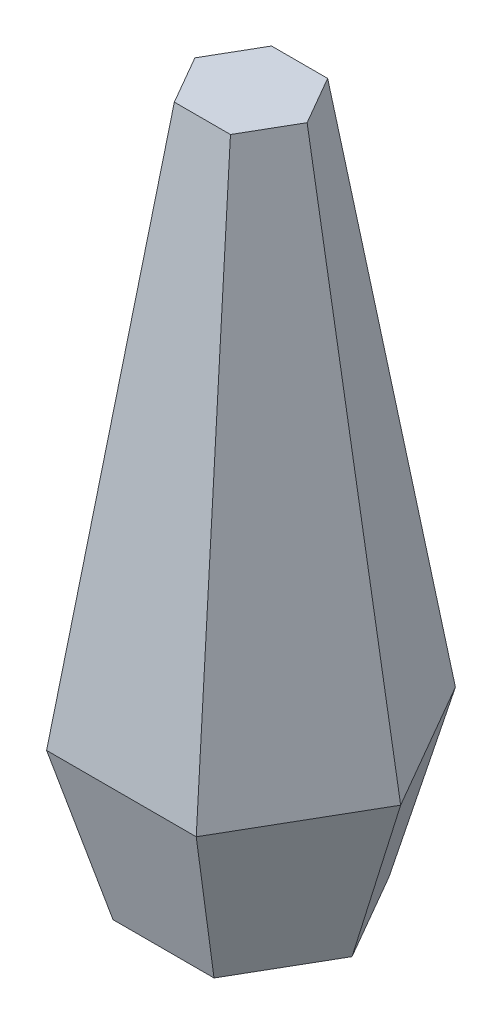
ISO-10303-21;
HEADER;
FILE_DESCRIPTION(('STEP AP214'),'2;1');
FILE_NAME('part.step','',(''),(''),'','','');
FILE_SCHEMA(('AUTOMOTIVE_DESIGN { 1 0 10303 214 1 1 1 1 }'));
ENDSEC;
DATA;
#1=APPLICATION_CONTEXT('core data for automotive mechanical design processes');
#2=APPLICATION_PROTOCOL_DEFINITION('international standard','automotive_design',2000,#1);
#3=PRODUCT_CONTEXT('',#1,'mechanical');
#4=PRODUCT('Part','Part','',(#3));
#5=PRODUCT_RELATED_PRODUCT_CATEGORY('part','',(#4));
#6=PRODUCT_DEFINITION_FORMATION('','',#4);
#7=PRODUCT_DEFINITION_CONTEXT('part definition',#1,'design');
#8=PRODUCT_DEFINITION('design','',#6,#7);
#9=PRODUCT_DEFINITION_SHAPE('','',#8);
#10=(LENGTH_UNIT() NAMED_UNIT(*) SI_UNIT(.MILLI.,.METRE.));
#11=(NAMED_UNIT(*) PLANE_ANGLE_UNIT() SI_UNIT($,.RADIAN.));
#12=(NAMED_UNIT(*) SI_UNIT($,.STERADIAN.) SOLID_ANGLE_UNIT());
#13=UNCERTAINTY_MEASURE_WITH_UNIT(LENGTH_MEASURE(1.E-05),#10,'distance_accuracy_value','');
#14=(GEOMETRIC_REPRESENTATION_CONTEXT(3) GLOBAL_UNCERTAINTY_ASSIGNED_CONTEXT((#13)) GLOBAL_UNIT_ASSIGNED_CONTEXT((#10,
#11,#12)) REPRESENTATION_CONTEXT('',''));
#15=CARTESIAN_POINT('',(0.,0.,0.));
#16=DIRECTION('',(0.,0.,1.));
#17=DIRECTION('',(1.,0.,0.));
#18=AXIS2_PLACEMENT_3D('',#15,#16,#17);
#19=CARTESIAN_POINT('',(395.946814610246,0.,0.));
#20=DIRECTION('',(0.,1.,0.));
#21=DIRECTION('',(0.,0.,1.));
#22=AXIS2_PLACEMENT_3D('',#19,#20,#21);
#23=PLANE('',#22);
#24=DIRECTION('',(0.5,0.,-0.866025403784439));
#25=VECTOR('',#24,1.);
#26=CARTESIAN_POINT('',(197.973407305123,0.,342.900000000001));
#27=LINE('',#26,#25);
#28=CARTESIAN_POINT('',(197.973407305123,0.,342.900000000001));
#29=VERTEX_POINT('',#28);
#30=CARTESIAN_POINT('',(395.946814610246,0.,0.));
#31=VERTEX_POINT('',#30);
#32=EDGE_CURVE('E205',#29,#31,#27,.T.);
#33=ORIENTED_EDGE('',*,*,#32,.F.);
#34=DIRECTION('',(1.,0.,0.));
#35=VECTOR('',#34,1.);
#36=CARTESIAN_POINT('',(-197.973407305123,0.,342.900000000001));
#37=LINE('',#36,#35);
#38=CARTESIAN_POINT('',(-197.973407305123,0.,342.900000000001));
#39=VERTEX_POINT('',#38);
#40=EDGE_CURVE('E12',#39,#29,#37,.T.);
#41=ORIENTED_EDGE('',*,*,#40,.F.);
#42=DIRECTION('',(0.5,0.,0.866025403784439));
#43=VECTOR('',#42,1.);
#44=CARTESIAN_POINT('',(-395.946814610246,0.,-2.22044604925031E-13));
#45=LINE('',#44,#43);
#46=CARTESIAN_POINT('',(-395.946814610246,0.,-2.22044604925031E-13));
#47=VERTEX_POINT('',#46);
#48=EDGE_CURVE('E68',#47,#39,#45,.T.);
#49=ORIENTED_EDGE('',*,*,#48,.F.);
#50=DIRECTION('',(-0.5,0.,0.866025403784439));
#51=VECTOR('',#50,1.);
#52=CARTESIAN_POINT('',(-197.973407305123,0.,-342.900000000001));
#53=LINE('',#52,#51);
#54=CARTESIAN_POINT('',(-197.973407305123,0.,-342.900000000001));
#55=VERTEX_POINT('',#54);
#56=EDGE_CURVE('E141',#55,#47,#53,.T.);
#57=ORIENTED_EDGE('',*,*,#56,.F.);
#58=DIRECTION('',(-1.,0.,0.));
#59=VECTOR('',#58,1.);
#60=CARTESIAN_POINT('',(197.973407305122,0.,-342.900000000001));
#61=LINE('',#60,#59);
#62=CARTESIAN_POINT('',(197.973407305122,0.,-342.900000000001));
#63=VERTEX_POINT('',#62);
#64=EDGE_CURVE('E158',#63,#55,#61,.T.);
#65=ORIENTED_EDGE('',*,*,#64,.F.);
#66=DIRECTION('',(-0.5,0.,-0.866025403784439));
#67=VECTOR('',#66,1.);
#68=CARTESIAN_POINT('',(395.946814610246,0.,0.));
#69=LINE('',#68,#67);
#70=EDGE_CURVE('E253',#31,#63,#69,.T.);
#71=ORIENTED_EDGE('',*,*,#70,.F.);
#72=EDGE_LOOP('',(#33,#41,#49,#57,#65,#71));
#73=FACE_BOUND('',#72,.T.);
#74=ADVANCED_FACE('F56',(#73),#23,.F.);
#75=CARTESIAN_POINT('',(-293.293936748342,609.6,-507.999999999999));
#76=DIRECTION('',(0.,0.261415475728317,0.965226371919944));
#77=DIRECTION('',(0.,-0.965226371919944,0.261415475728317));
#78=AXIS2_PLACEMENT_3D('',#75,#76,#77);
#79=PLANE('',#78);
#80=DIRECTION('',(-0.149238093107542,0.954417081920958,-0.258487959686922));
#81=VECTOR('',#80,1.);
#82=CARTESIAN_POINT('',(-197.973407305123,0.,-342.900000000001));
#83=LINE('',#82,#81);
#84=CARTESIAN_POINT('',(-293.293936748342,609.6,-507.999999999999));
#85=VERTEX_POINT('',#84);
#86=EDGE_CURVE('E157',#55,#85,#83,.T.);
#87=ORIENTED_EDGE('',*,*,#86,.T.);
#88=DIRECTION('',(-1.,0.,0.));
#89=VECTOR('',#88,1.);
#90=CARTESIAN_POINT('',(293.293936748324,609.6,-508.000000000009));
#91=LINE('',#90,#89);
#92=CARTESIAN_POINT('',(293.293936748324,609.6,-508.000000000009));
#93=VERTEX_POINT('',#92);
#94=EDGE_CURVE('E303',#93,#85,#91,.T.);
#95=ORIENTED_EDGE('',*,*,#94,.F.);
#96=DIRECTION('',(0.149238093107515,0.954417081920958,-0.258487959686939));
#97=VECTOR('',#96,1.);
#98=CARTESIAN_POINT('',(197.973407305122,0.,-342.900000000001));
#99=LINE('',#98,#97);
#100=EDGE_CURVE('E167',#63,#93,#99,.T.);
#101=ORIENTED_EDGE('',*,*,#100,.F.);
#102=ORIENTED_EDGE('',*,*,#64,.T.);
#103=EDGE_LOOP('',(#87,#95,#101,#102));
#104=FACE_BOUND('',#103,.T.);
#105=ADVANCED_FACE('F229',(#104),#79,.F.);
#106=CARTESIAN_POINT('',(293.293936748324,609.6,-508.000000000009));
#107=DIRECTION('',(-0.83591055848535,0.261415475728319,0.482613185959984));
#108=DIRECTION('',(0.500000000000013,0.,0.866025403784431));
#109=AXIS2_PLACEMENT_3D('',#106,#107,#108);
#110=PLANE('',#109);
#111=ORIENTED_EDGE('',*,*,#100,.T.);
#112=DIRECTION('',(-0.500000000000013,0.,-0.866025403784431));
#113=VECTOR('',#112,1.);
#114=CARTESIAN_POINT('',(586.587873496665,609.6,-8.26408112426448E-12));
#115=LINE('',#114,#113);
#116=CARTESIAN_POINT('',(586.587873496665,609.6,-8.10462807976364E-12));
#117=VERTEX_POINT('',#116);
#118=EDGE_CURVE('E98',#117,#93,#115,.T.);
#119=ORIENTED_EDGE('',*,*,#118,.F.);
#120=DIRECTION('',(0.298476186215055,0.954417081920958,0.));
#121=VECTOR('',#120,1.);
#122=CARTESIAN_POINT('',(395.946814610246,0.,0.));
#123=LINE('',#122,#121);
#124=EDGE_CURVE('E651',#31,#117,#123,.T.);
#125=ORIENTED_EDGE('',*,*,#124,.F.);
#126=ORIENTED_EDGE('',*,*,#70,.T.);
#127=EDGE_LOOP('',(#111,#119,#125,#126));
#128=FACE_BOUND('',#127,.T.);
#129=ADVANCED_FACE('F283',(#128),#110,.F.);
#130=CARTESIAN_POINT('',(-586.587873496669,609.6,1.11022302462516E-13));
#131=DIRECTION('',(0.835910558485357,0.26141547572833,0.482613185959968));
#132=DIRECTION('',(0.499999999999998,0.,-0.86602540378444));
#133=AXIS2_PLACEMENT_3D('',#130,#131,#132);
#134=PLANE('',#133);
#135=DIRECTION('',(-0.298476186215061,0.954417081920956,0.));
#136=VECTOR('',#135,1.);
#137=CARTESIAN_POINT('',(-395.946814610246,0.,-2.22044604925031E-13));
#138=LINE('',#137,#136);
#139=CARTESIAN_POINT('',(-586.587873496669,609.6,1.11022302462516E-13));
#140=VERTEX_POINT('',#139);
#141=EDGE_CURVE('E154',#47,#140,#138,.T.);
#142=ORIENTED_EDGE('',*,*,#141,.T.);
#143=DIRECTION('',(-0.499999999999998,0.,0.86602540378444));
#144=VECTOR('',#143,1.);
#145=CARTESIAN_POINT('',(-293.293936748342,609.6,-507.999999999999));
#146=LINE('',#145,#144);
#147=EDGE_CURVE('E312',#85,#140,#146,.T.);
#148=ORIENTED_EDGE('',*,*,#147,.F.);
#149=ORIENTED_EDGE('',*,*,#86,.F.);
#150=ORIENTED_EDGE('',*,*,#56,.T.);
#151=EDGE_LOOP('',(#142,#148,#149,#150));
#152=FACE_BOUND('',#151,.T.);
#153=ADVANCED_FACE('F153',(#152),#134,.F.);
#154=CARTESIAN_POINT('',(-293.293936748335,609.6,508.000000000009));
#155=DIRECTION('',(0.835910558485355,0.26141547572833,-0.48261318595997));
#156=DIRECTION('',(-0.5,0.,-0.866025403784439));
#157=AXIS2_PLACEMENT_3D('',#154,#155,#156);
#158=PLANE('',#157);
#159=DIRECTION('',(-0.149238093107531,0.954417081920956,0.258487959686938));
#160=VECTOR('',#159,1.);
#161=CARTESIAN_POINT('',(-197.973407305123,0.,342.900000000001));
#162=LINE('',#161,#160);
#163=CARTESIAN_POINT('',(-293.293936748335,609.6,508.000000000009));
#164=VERTEX_POINT('',#163);
#165=EDGE_CURVE('E106',#39,#164,#162,.T.);
#166=ORIENTED_EDGE('',*,*,#165,.T.);
#167=DIRECTION('',(0.5,0.,0.866025403784439));
#168=VECTOR('',#167,1.);
#169=CARTESIAN_POINT('',(-586.587873496669,609.6,1.15034043465789E-13));
#170=LINE('',#169,#168);
#171=EDGE_CURVE('E164',#140,#164,#170,.T.);
#172=ORIENTED_EDGE('',*,*,#171,.F.);
#173=ORIENTED_EDGE('',*,*,#141,.F.);
#174=ORIENTED_EDGE('',*,*,#48,.T.);
#175=EDGE_LOOP('',(#166,#172,#173,#174));
#176=FACE_BOUND('',#175,.T.);
#177=ADVANCED_FACE('F162',(#176),#158,.F.);
#178=CARTESIAN_POINT('',(293.293936748335,609.6,508.000000000008));
#179=DIRECTION('',(0.,0.26141547572833,-0.96522637191994));
#180=DIRECTION('',(0.,0.965226371919941,0.26141547572833));
#181=AXIS2_PLACEMENT_3D('',#178,#179,#180);
#182=PLANE('',#181);
#183=DIRECTION('',(0.149238093107531,0.954417081920956,0.258487959686938));
#184=VECTOR('',#183,1.);
#185=CARTESIAN_POINT('',(197.973407305123,0.,342.900000000001));
#186=LINE('',#185,#184);
#187=CARTESIAN_POINT('',(293.293936748335,609.6,508.000000000008));
#188=VERTEX_POINT('',#187);
#189=EDGE_CURVE('E77',#29,#188,#186,.T.);
#190=ORIENTED_EDGE('',*,*,#189,.T.);
#191=DIRECTION('',(1.,0.,0.));
#192=VECTOR('',#191,1.);
#193=CARTESIAN_POINT('',(-293.293936748335,609.6,508.000000000009));
#194=LINE('',#193,#192);
#195=EDGE_CURVE('E326',#164,#188,#194,.T.);
#196=ORIENTED_EDGE('',*,*,#195,.F.);
#197=ORIENTED_EDGE('',*,*,#165,.F.);
#198=ORIENTED_EDGE('',*,*,#40,.T.);
#199=EDGE_LOOP('',(#190,#196,#197,#198));
#200=FACE_BOUND('',#199,.T.);
#201=ADVANCED_FACE('F188',(#200),#182,.F.);
#202=CARTESIAN_POINT('',(586.587873496665,609.6,-8.10462807976364E-12));
#203=DIRECTION('',(-0.835910558485364,0.26141547572832,-0.48261318595996));
#204=DIRECTION('',(-0.499999999999988,0.,0.866025403784446));
#205=AXIS2_PLACEMENT_3D('',#202,#203,#204);
#206=PLANE('',#205);
#207=ORIENTED_EDGE('',*,*,#124,.T.);
#208=DIRECTION('',(0.499999999999988,0.,-0.866025403784446));
#209=VECTOR('',#208,1.);
#210=CARTESIAN_POINT('',(293.293936748335,609.6,508.000000000008));
#211=LINE('',#210,#209);
#212=EDGE_CURVE('E61',#188,#117,#211,.T.);
#213=ORIENTED_EDGE('',*,*,#212,.F.);
#214=ORIENTED_EDGE('',*,*,#189,.F.);
#215=ORIENTED_EDGE('',*,*,#32,.T.);
#216=EDGE_LOOP('',(#207,#213,#214,#215));
#217=FACE_BOUND('',#216,.T.);
#218=ADVANCED_FACE('F58',(#217),#206,.F.);
#219=CARTESIAN_POINT('',(-219.970452561247,2743.2,0.));
#220=DIRECTION('',(0.,1.,0.));
#221=DIRECTION('',(0.,0.,1.));
#222=AXIS2_PLACEMENT_3D('',#219,#220,#221);
#223=PLANE('',#222);
#224=DIRECTION('',(-0.5,0.,0.866025403784439));
#225=VECTOR('',#224,1.);
#226=CARTESIAN_POINT('',(-109.985226280624,2743.2,-190.5));
#227=LINE('',#226,#225);
#228=CARTESIAN_POINT('',(-109.985226280624,2743.2,-190.5));
#229=VERTEX_POINT('',#228);
#230=CARTESIAN_POINT('',(-219.970452561248,2743.2,0.));
#231=VERTEX_POINT('',#230);
#232=EDGE_CURVE('E466',#229,#231,#227,.T.);
#233=ORIENTED_EDGE('',*,*,#232,.T.);
#234=DIRECTION('',(0.5,0.,0.866025403784439));
#235=VECTOR('',#234,1.);
#236=CARTESIAN_POINT('',(-219.970452561248,2743.2,0.));
#237=LINE('',#236,#235);
#238=CARTESIAN_POINT('',(-109.985226280624,2743.2,190.5));
#239=VERTEX_POINT('',#238);
#240=EDGE_CURVE('E396',#231,#239,#237,.T.);
#241=ORIENTED_EDGE('',*,*,#240,.T.);
#242=DIRECTION('',(1.,0.,0.));
#243=VECTOR('',#242,1.);
#244=CARTESIAN_POINT('',(-109.985226280624,2743.2,190.5));
#245=LINE('',#244,#243);
#246=CARTESIAN_POINT('',(109.985226280624,2743.2,190.5));
#247=VERTEX_POINT('',#246);
#248=EDGE_CURVE('E474',#239,#247,#245,.T.);
#249=ORIENTED_EDGE('',*,*,#248,.T.);
#250=DIRECTION('',(0.5,0.,-0.866025403784439));
#251=VECTOR('',#250,1.);
#252=CARTESIAN_POINT('',(109.985226280624,2743.2,190.5));
#253=LINE('',#252,#251);
#254=CARTESIAN_POINT('',(219.970452561248,2743.2,0.));
#255=VERTEX_POINT('',#254);
#256=EDGE_CURVE('E442',#247,#255,#253,.T.);
#257=ORIENTED_EDGE('',*,*,#256,.T.);
#258=DIRECTION('',(-0.5,0.,-0.866025403784438));
#259=VECTOR('',#258,1.);
#260=CARTESIAN_POINT('',(219.970452561248,2743.2,0.));
#261=LINE('',#260,#259);
#262=CARTESIAN_POINT('',(109.985226280624,2743.2,-190.5));
#263=VERTEX_POINT('',#262);
#264=EDGE_CURVE('E437',#255,#263,#261,.T.);
#265=ORIENTED_EDGE('',*,*,#264,.T.);
#266=DIRECTION('',(-1.,0.,0.));
#267=VECTOR('',#266,1.);
#268=CARTESIAN_POINT('',(109.985226280624,2743.2,-190.5));
#269=LINE('',#268,#267);
#270=EDGE_CURVE('E424',#263,#229,#269,.T.);
#271=ORIENTED_EDGE('',*,*,#270,.T.);
#272=EDGE_LOOP('',(#233,#241,#249,#257,#265,#271));
#273=FACE_BOUND('',#272,.T.);
#274=ADVANCED_FACE('F230',(#273),#223,.T.);
#275=CARTESIAN_POINT('',(-219.970452561248,2743.2,1.11022302462516E-13));
#276=DIRECTION('',(0.856593020736892,-0.147188753306075,0.494554211108399));
#277=DIRECTION('',(0.5,0.,-0.866025403784439));
#278=AXIS2_PLACEMENT_3D('',#275,#276,#277);
#279=PLANE('',#278);
#280=DIRECTION('',(0.169348556541042,0.985556221834891,0.));
#281=VECTOR('',#280,1.);
#282=CARTESIAN_POINT('',(-586.587873496669,609.6,1.15034043465789E-13));
#283=LINE('',#282,#281);
#284=EDGE_CURVE('E350',#140,#231,#283,.T.);
#285=ORIENTED_EDGE('',*,*,#284,.T.);
#286=ORIENTED_EDGE('',*,*,#232,.F.);
#287=DIRECTION('',(0.0846742782705242,0.985556221834892,0.146660152058763));
#288=VECTOR('',#287,1.);
#289=CARTESIAN_POINT('',(-293.293936748342,609.6,-507.999999999999));
#290=LINE('',#289,#288);
#291=EDGE_CURVE('E344',#85,#229,#290,.T.);
#292=ORIENTED_EDGE('',*,*,#291,.F.);
#293=ORIENTED_EDGE('',*,*,#147,.T.);
#294=EDGE_LOOP('',(#285,#286,#292,#293));
#295=FACE_BOUND('',#294,.T.);
#296=ADVANCED_FACE('F368',(#295),#279,.F.);
#297=CARTESIAN_POINT('',(-109.985226280624,2743.2,-190.5));
#298=DIRECTION('',(0.,-0.147188753306071,0.989108422216799));
#299=DIRECTION('',(0.,-0.989108422216799,-0.147188753306071));
#300=AXIS2_PLACEMENT_3D('',#297,#298,#299);
#301=PLANE('',#300);
#302=ORIENTED_EDGE('',*,*,#291,.T.);
#303=ORIENTED_EDGE('',*,*,#270,.F.);
#304=DIRECTION('',(-0.084674278270516,0.985556221834892,0.146660152058768));
#305=VECTOR('',#304,1.);
#306=CARTESIAN_POINT('',(293.293936748324,609.6,-508.000000000009));
#307=LINE('',#306,#305);
#308=EDGE_CURVE('E433',#93,#263,#307,.T.);
#309=ORIENTED_EDGE('',*,*,#308,.F.);
#310=ORIENTED_EDGE('',*,*,#94,.T.);
#311=EDGE_LOOP('',(#302,#303,#309,#310));
#312=FACE_BOUND('',#311,.T.);
#313=ADVANCED_FACE('F376',(#312),#301,.F.);
#314=CARTESIAN_POINT('',(-109.985226280624,2743.2,190.5));
#315=DIRECTION('',(0.856593020736891,-0.147188753306075,-0.494554211108399));
#316=DIRECTION('',(-0.5,0.,-0.866025403784439));
#317=AXIS2_PLACEMENT_3D('',#314,#315,#316);
#318=PLANE('',#317);
#319=DIRECTION('',(0.0846742782705208,0.985556221834891,-0.146660152058767));
#320=VECTOR('',#319,1.);
#321=CARTESIAN_POINT('',(-293.293936748335,609.6,508.000000000009));
#322=LINE('',#321,#320);
#323=EDGE_CURVE('E354',#164,#239,#322,.T.);
#324=ORIENTED_EDGE('',*,*,#323,.T.);
#325=ORIENTED_EDGE('',*,*,#240,.F.);
#326=ORIENTED_EDGE('',*,*,#284,.F.);
#327=ORIENTED_EDGE('',*,*,#171,.T.);
#328=EDGE_LOOP('',(#324,#325,#326,#327));
#329=FACE_BOUND('',#328,.T.);
#330=ADVANCED_FACE('F401',(#329),#318,.F.);
#331=CARTESIAN_POINT('',(109.985226280624,2743.2,190.5));
#332=DIRECTION('',(0.,-0.147188753306075,-0.989108422216798));
#333=DIRECTION('',(0.,0.989108422216798,-0.147188753306075));
#334=AXIS2_PLACEMENT_3D('',#331,#332,#333);
#335=PLANE('',#334);
#336=DIRECTION('',(-0.0846742782705209,0.985556221834891,-0.146660152058767));
#337=VECTOR('',#336,1.);
#338=CARTESIAN_POINT('',(293.293936748335,609.6,508.000000000008));
#339=LINE('',#338,#337);
#340=EDGE_CURVE('E496',#188,#247,#339,.T.);
#341=ORIENTED_EDGE('',*,*,#340,.T.);
#342=ORIENTED_EDGE('',*,*,#248,.F.);
#343=ORIENTED_EDGE('',*,*,#323,.F.);
#344=ORIENTED_EDGE('',*,*,#195,.T.);
#345=EDGE_LOOP('',(#341,#342,#343,#344));
#346=FACE_BOUND('',#345,.T.);
#347=ADVANCED_FACE('F410',(#346),#335,.F.);
#348=CARTESIAN_POINT('',(219.970452561248,2743.2,0.));
#349=DIRECTION('',(-0.856593020736892,-0.147188753306071,-0.494554211108399));
#350=DIRECTION('',(-0.5,0.,0.866025403784439));
#351=AXIS2_PLACEMENT_3D('',#348,#349,#350);
#352=PLANE('',#351);
#353=DIRECTION('',(-0.16934855654104,0.985556221834892,0.));
#354=VECTOR('',#353,1.);
#355=CARTESIAN_POINT('',(586.587873496665,609.6,-8.26408112426448E-12));
#356=LINE('',#355,#354);
#357=EDGE_CURVE('E498',#117,#255,#356,.T.);
#358=ORIENTED_EDGE('',*,*,#357,.T.);
#359=ORIENTED_EDGE('',*,*,#256,.F.);
#360=ORIENTED_EDGE('',*,*,#340,.F.);
#361=ORIENTED_EDGE('',*,*,#212,.T.);
#362=EDGE_LOOP('',(#358,#359,#360,#361));
#363=FACE_BOUND('',#362,.T.);
#364=ADVANCED_FACE('F513',(#363),#352,.F.);
#365=CARTESIAN_POINT('',(109.985226280624,2743.2,-190.5));
#366=DIRECTION('',(-0.856593020736892,-0.147188753306071,0.4945542111084));
#367=DIRECTION('',(0.5,0.,0.866025403784438));
#368=AXIS2_PLACEMENT_3D('',#365,#366,#367);
#369=PLANE('',#368);
#370=ORIENTED_EDGE('',*,*,#308,.T.);
#371=ORIENTED_EDGE('',*,*,#264,.F.);
#372=ORIENTED_EDGE('',*,*,#357,.F.);
#373=ORIENTED_EDGE('',*,*,#118,.T.);
#374=EDGE_LOOP('',(#370,#371,#372,#373));
#375=FACE_BOUND('',#374,.T.);
#376=ADVANCED_FACE('F521',(#375),#369,.F.);
#377=CLOSED_SHELL('',(#74,#105,#129,#153,#177,#201,#218,#274,#296,#313,#330,#347,#364,#376));
#378=MANIFOLD_SOLID_BREP('B2',#377);
#379=ADVANCED_BREP_SHAPE_REPRESENTATION('',(#18,#378),#14);
#380=SHAPE_DEFINITION_REPRESENTATION(#9,#379);
ENDSEC;
END-ISO-10303-21;
